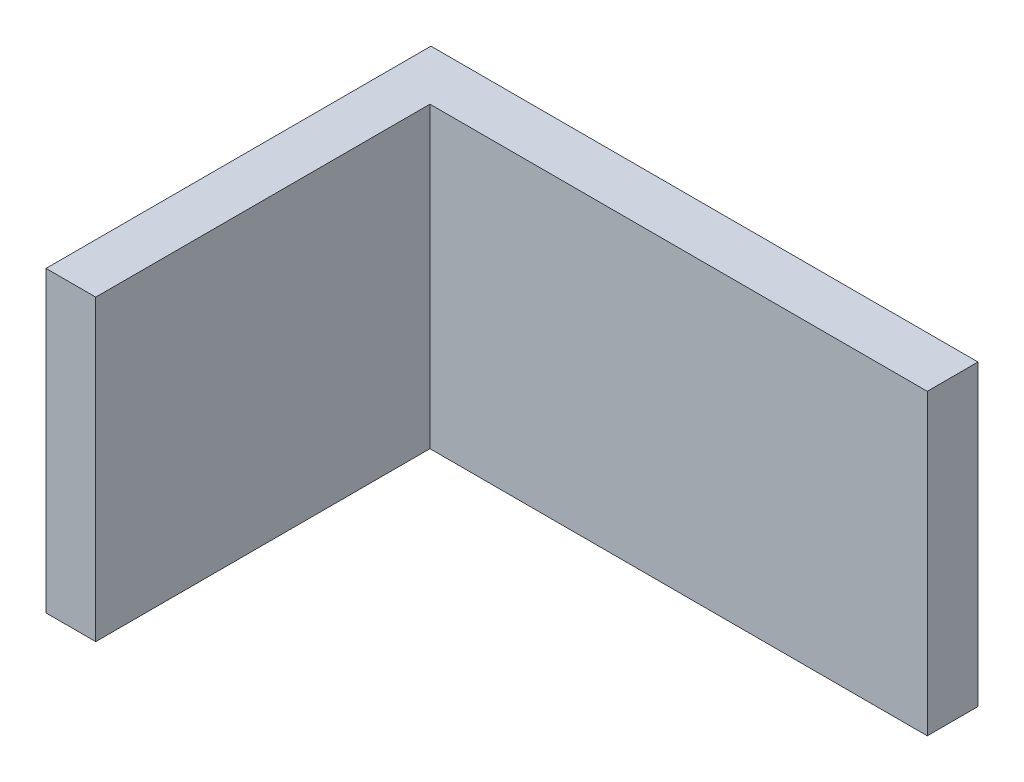
ISO-10303-21;
HEADER;
FILE_DESCRIPTION(('STEP AP214'),'2;1');
FILE_NAME('part.step','',(''),(''),'','','');
FILE_SCHEMA(('AUTOMOTIVE_DESIGN { 1 0 10303 214 1 1 1 1 }'));
ENDSEC;
DATA;
#1=APPLICATION_CONTEXT('core data for automotive mechanical design processes');
#2=APPLICATION_PROTOCOL_DEFINITION('international standard','automotive_design',2000,#1);
#3=PRODUCT_CONTEXT('',#1,'mechanical');
#4=PRODUCT('Part','Part','',(#3));
#5=PRODUCT_RELATED_PRODUCT_CATEGORY('part','',(#4));
#6=PRODUCT_DEFINITION_FORMATION('','',#4);
#7=PRODUCT_DEFINITION_CONTEXT('part definition',#1,'design');
#8=PRODUCT_DEFINITION('design','',#6,#7);
#9=PRODUCT_DEFINITION_SHAPE('','',#8);
#10=(LENGTH_UNIT() NAMED_UNIT(*) SI_UNIT(.MILLI.,.METRE.));
#11=(NAMED_UNIT(*) PLANE_ANGLE_UNIT() SI_UNIT($,.RADIAN.));
#12=(NAMED_UNIT(*) SI_UNIT($,.STERADIAN.) SOLID_ANGLE_UNIT());
#13=UNCERTAINTY_MEASURE_WITH_UNIT(LENGTH_MEASURE(1.E-05),#10,'distance_accuracy_value','');
#14=(GEOMETRIC_REPRESENTATION_CONTEXT(3) GLOBAL_UNCERTAINTY_ASSIGNED_CONTEXT((#13)) GLOBAL_UNIT_ASSIGNED_CONTEXT((#10,
#11,#12)) REPRESENTATION_CONTEXT('',''));
#15=CARTESIAN_POINT('',(0.,0.,0.));
#16=DIRECTION('',(0.,0.,1.));
#17=DIRECTION('',(1.,0.,0.));
#18=AXIS2_PLACEMENT_3D('',#15,#16,#17);
#19=CARTESIAN_POINT('',(-4.55,3.6,0.));
#20=DIRECTION('',(0.,-1.,0.));
#21=DIRECTION('',(0.,0.,1.));
#22=AXIS2_PLACEMENT_3D('',#19,#20,#21);
#23=PLANE('',#22);
#24=DIRECTION('',(-1.,0.,0.));
#25=VECTOR('',#24,1.);
#26=CARTESIAN_POINT('',(-4.,3.6,0.));
#27=LINE('',#26,#25);
#28=CARTESIAN_POINT('',(-4.,3.6,0.));
#29=VERTEX_POINT('',#28);
#30=CARTESIAN_POINT('',(-4.55,3.6,0.));
#31=VERTEX_POINT('',#30);
#32=EDGE_CURVE('E11',#29,#31,#27,.T.);
#33=ORIENTED_EDGE('',*,*,#32,.F.);
#34=DIRECTION('',(0.,0.,-1.));
#35=VECTOR('',#34,1.);
#36=CARTESIAN_POINT('',(-4.,3.6,0.051));
#37=LINE('',#36,#35);
#38=CARTESIAN_POINT('',(-4.,3.6,0.051));
#39=VERTEX_POINT('',#38);
#40=EDGE_CURVE('E24',#39,#29,#37,.T.);
#41=ORIENTED_EDGE('',*,*,#40,.F.);
#42=DIRECTION('',(1.,0.,0.));
#43=VECTOR('',#42,1.);
#44=CARTESIAN_POINT('',(-4.5,3.6,0.051));
#45=LINE('',#44,#43);
#46=CARTESIAN_POINT('',(-4.5,3.6,0.051));
#47=VERTEX_POINT('',#46);
#48=EDGE_CURVE('E87',#47,#39,#45,.T.);
#49=ORIENTED_EDGE('',*,*,#48,.F.);
#50=DIRECTION('',(0.,0.,-1.));
#51=VECTOR('',#50,1.);
#52=CARTESIAN_POINT('',(-4.5,3.6,0.387));
#53=LINE('',#52,#51);
#54=CARTESIAN_POINT('',(-4.5,3.6,0.387));
#55=VERTEX_POINT('',#54);
#56=EDGE_CURVE('E114',#55,#47,#53,.T.);
#57=ORIENTED_EDGE('',*,*,#56,.F.);
#58=DIRECTION('',(1.,0.,0.));
#59=VECTOR('',#58,1.);
#60=CARTESIAN_POINT('',(-4.55,3.6,0.387));
#61=LINE('',#60,#59);
#62=CARTESIAN_POINT('',(-4.55,3.6,0.387));
#63=VERTEX_POINT('',#62);
#64=EDGE_CURVE('E111',#63,#55,#61,.T.);
#65=ORIENTED_EDGE('',*,*,#64,.F.);
#66=DIRECTION('',(0.,0.,1.));
#67=VECTOR('',#66,1.);
#68=CARTESIAN_POINT('',(-4.55,3.6,0.));
#69=LINE('',#68,#67);
#70=EDGE_CURVE('E108',#31,#63,#69,.T.);
#71=ORIENTED_EDGE('',*,*,#70,.F.);
#72=EDGE_LOOP('',(#33,#41,#49,#57,#65,#71));
#73=FACE_BOUND('',#72,.T.);
#74=ADVANCED_FACE('F17',(#73),#23,.T.);
#75=CARTESIAN_POINT('',(-4.,3.9,0.));
#76=DIRECTION('',(0.,1.,0.));
#77=DIRECTION('',(0.,0.,1.));
#78=AXIS2_PLACEMENT_3D('',#75,#76,#77);
#79=PLANE('',#78);
#80=DIRECTION('',(1.,0.,0.));
#81=VECTOR('',#80,1.);
#82=CARTESIAN_POINT('',(-4.55,3.9,0.));
#83=LINE('',#82,#81);
#84=CARTESIAN_POINT('',(-4.55,3.9,0.));
#85=VERTEX_POINT('',#84);
#86=CARTESIAN_POINT('',(-4.,3.9,0.));
#87=VERTEX_POINT('',#86);
#88=EDGE_CURVE('E106',#85,#87,#83,.T.);
#89=ORIENTED_EDGE('',*,*,#88,.F.);
#90=DIRECTION('',(0.,0.,-1.));
#91=VECTOR('',#90,1.);
#92=CARTESIAN_POINT('',(-4.55,3.9,0.387));
#93=LINE('',#92,#91);
#94=CARTESIAN_POINT('',(-4.55,3.9,0.387));
#95=VERTEX_POINT('',#94);
#96=EDGE_CURVE('E103',#95,#85,#93,.T.);
#97=ORIENTED_EDGE('',*,*,#96,.F.);
#98=DIRECTION('',(-1.,0.,0.));
#99=VECTOR('',#98,1.);
#100=CARTESIAN_POINT('',(-4.5,3.9,0.387));
#101=LINE('',#100,#99);
#102=CARTESIAN_POINT('',(-4.5,3.9,0.387));
#103=VERTEX_POINT('',#102);
#104=EDGE_CURVE('E100',#103,#95,#101,.T.);
#105=ORIENTED_EDGE('',*,*,#104,.F.);
#106=DIRECTION('',(0.,0.,1.));
#107=VECTOR('',#106,1.);
#108=CARTESIAN_POINT('',(-4.5,3.9,0.051));
#109=LINE('',#108,#107);
#110=CARTESIAN_POINT('',(-4.5,3.9,0.051));
#111=VERTEX_POINT('',#110);
#112=EDGE_CURVE('E72',#111,#103,#109,.T.);
#113=ORIENTED_EDGE('',*,*,#112,.F.);
#114=DIRECTION('',(-1.,0.,0.));
#115=VECTOR('',#114,1.);
#116=CARTESIAN_POINT('',(-4.,3.9,0.051));
#117=LINE('',#116,#115);
#118=CARTESIAN_POINT('',(-4.,3.9,0.051));
#119=VERTEX_POINT('',#118);
#120=EDGE_CURVE('E66',#119,#111,#117,.T.);
#121=ORIENTED_EDGE('',*,*,#120,.F.);
#122=DIRECTION('',(0.,0.,1.));
#123=VECTOR('',#122,1.);
#124=CARTESIAN_POINT('',(-4.,3.9,0.));
#125=LINE('',#124,#123);
#126=EDGE_CURVE('E69',#87,#119,#125,.T.);
#127=ORIENTED_EDGE('',*,*,#126,.F.);
#128=EDGE_LOOP('',(#89,#97,#105,#113,#121,#127));
#129=FACE_BOUND('',#128,.T.);
#130=ADVANCED_FACE('F68',(#129),#79,.T.);
#131=CARTESIAN_POINT('',(-4.55,3.6,0.387));
#132=DIRECTION('',(0.,0.,1.));
#133=DIRECTION('',(0.,1.,0.));
#134=AXIS2_PLACEMENT_3D('',#131,#132,#133);
#135=PLANE('',#134);
#136=ORIENTED_EDGE('',*,*,#64,.T.);
#137=DIRECTION('',(0.,-1.,0.));
#138=VECTOR('',#137,1.);
#139=CARTESIAN_POINT('',(-4.5,3.9,0.387));
#140=LINE('',#139,#138);
#141=EDGE_CURVE('E83',#103,#55,#140,.T.);
#142=ORIENTED_EDGE('',*,*,#141,.F.);
#143=ORIENTED_EDGE('',*,*,#104,.T.);
#144=DIRECTION('',(0.,1.,0.));
#145=VECTOR('',#144,1.);
#146=CARTESIAN_POINT('',(-4.55,3.6,0.387));
#147=LINE('',#146,#145);
#148=EDGE_CURVE('E88',#63,#95,#147,.T.);
#149=ORIENTED_EDGE('',*,*,#148,.F.);
#150=EDGE_LOOP('',(#136,#142,#143,#149));
#151=FACE_BOUND('',#150,.T.);
#152=ADVANCED_FACE('F125',(#151),#135,.T.);
#153=CARTESIAN_POINT('',(-4.5,3.6,0.051));
#154=DIRECTION('',(0.,0.,1.));
#155=DIRECTION('',(0.,1.,0.));
#156=AXIS2_PLACEMENT_3D('',#153,#154,#155);
#157=PLANE('',#156);
#158=ORIENTED_EDGE('',*,*,#48,.T.);
#159=DIRECTION('',(0.,-1.,0.));
#160=VECTOR('',#159,1.);
#161=CARTESIAN_POINT('',(-4.,3.9,0.051));
#162=LINE('',#161,#160);
#163=EDGE_CURVE('E81',#119,#39,#162,.T.);
#164=ORIENTED_EDGE('',*,*,#163,.F.);
#165=ORIENTED_EDGE('',*,*,#120,.T.);
#166=DIRECTION('',(0.,1.,0.));
#167=VECTOR('',#166,1.);
#168=CARTESIAN_POINT('',(-4.5,3.6,0.051));
#169=LINE('',#168,#167);
#170=EDGE_CURVE('E89',#47,#111,#169,.T.);
#171=ORIENTED_EDGE('',*,*,#170,.F.);
#172=EDGE_LOOP('',(#158,#164,#165,#171));
#173=FACE_BOUND('',#172,.T.);
#174=ADVANCED_FACE('F86',(#173),#157,.T.);
#175=CARTESIAN_POINT('',(-4.55,3.9,0.));
#176=DIRECTION('',(-1.,0.,0.));
#177=DIRECTION('',(0.,0.,1.));
#178=AXIS2_PLACEMENT_3D('',#175,#176,#177);
#179=PLANE('',#178);
#180=DIRECTION('',(0.,1.,0.));
#181=VECTOR('',#180,1.);
#182=CARTESIAN_POINT('',(-4.55,3.6,0.));
#183=LINE('',#182,#181);
#184=EDGE_CURVE('E93',#31,#85,#183,.T.);
#185=ORIENTED_EDGE('',*,*,#184,.F.);
#186=ORIENTED_EDGE('',*,*,#70,.T.);
#187=ORIENTED_EDGE('',*,*,#148,.T.);
#188=ORIENTED_EDGE('',*,*,#96,.T.);
#189=EDGE_LOOP('',(#185,#186,#187,#188));
#190=FACE_BOUND('',#189,.T.);
#191=ADVANCED_FACE('F121',(#190),#179,.T.);
#192=CARTESIAN_POINT('',(-4.,3.6,0.));
#193=DIRECTION('',(1.,0.,0.));
#194=DIRECTION('',(0.,0.,1.));
#195=AXIS2_PLACEMENT_3D('',#192,#193,#194);
#196=PLANE('',#195);
#197=DIRECTION('',(0.,-1.,0.));
#198=VECTOR('',#197,1.);
#199=CARTESIAN_POINT('',(-4.,3.9,0.));
#200=LINE('',#199,#198);
#201=EDGE_CURVE('E82',#87,#29,#200,.T.);
#202=ORIENTED_EDGE('',*,*,#201,.F.);
#203=ORIENTED_EDGE('',*,*,#126,.T.);
#204=ORIENTED_EDGE('',*,*,#163,.T.);
#205=ORIENTED_EDGE('',*,*,#40,.T.);
#206=EDGE_LOOP('',(#202,#203,#204,#205));
#207=FACE_BOUND('',#206,.T.);
#208=ADVANCED_FACE('F80',(#207),#196,.T.);
#209=CARTESIAN_POINT('',(-4.5,3.6,0.051));
#210=DIRECTION('',(1.,0.,0.));
#211=DIRECTION('',(0.,0.,1.));
#212=AXIS2_PLACEMENT_3D('',#209,#210,#211);
#213=PLANE('',#212);
#214=ORIENTED_EDGE('',*,*,#170,.T.);
#215=ORIENTED_EDGE('',*,*,#112,.T.);
#216=ORIENTED_EDGE('',*,*,#141,.T.);
#217=ORIENTED_EDGE('',*,*,#56,.T.);
#218=EDGE_LOOP('',(#214,#215,#216,#217));
#219=FACE_BOUND('',#218,.T.);
#220=ADVANCED_FACE('F127',(#219),#213,.T.);
#221=CARTESIAN_POINT('',(-4.55,3.9,0.));
#222=DIRECTION('',(0.,0.,-1.));
#223=DIRECTION('',(0.,1.,0.));
#224=AXIS2_PLACEMENT_3D('',#221,#222,#223);
#225=PLANE('',#224);
#226=ORIENTED_EDGE('',*,*,#88,.T.);
#227=ORIENTED_EDGE('',*,*,#201,.T.);
#228=ORIENTED_EDGE('',*,*,#32,.T.);
#229=ORIENTED_EDGE('',*,*,#184,.T.);
#230=EDGE_LOOP('',(#226,#227,#228,#229));
#231=FACE_BOUND('',#230,.T.);
#232=ADVANCED_FACE('F117',(#231),#225,.T.);
#233=CLOSED_SHELL('',(#74,#130,#152,#174,#191,#208,#220,#232));
#234=MANIFOLD_SOLID_BREP('B1',#233);
#235=ADVANCED_BREP_SHAPE_REPRESENTATION('',(#18,#234),#14);
#236=SHAPE_DEFINITION_REPRESENTATION(#9,#235);
ENDSEC;
END-ISO-10303-21;
